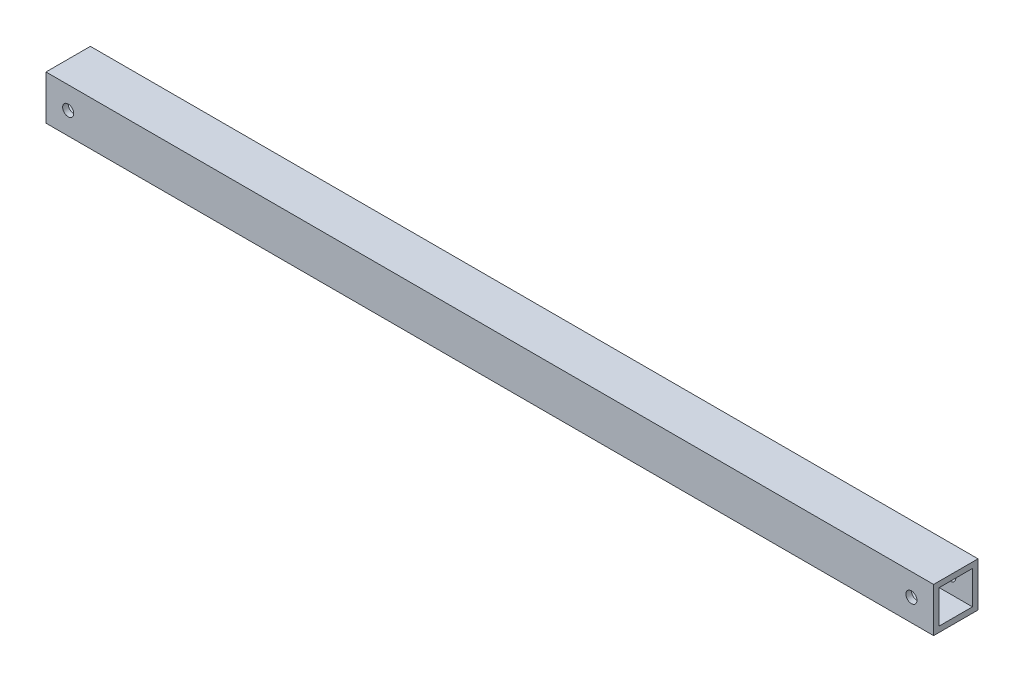
ISO-10303-21;
HEADER;
FILE_DESCRIPTION(('STEP AP214'),'2;1');
FILE_NAME('part.step','',(''),(''),'','','');
FILE_SCHEMA(('AUTOMOTIVE_DESIGN { 1 0 10303 214 1 1 1 1 }'));
ENDSEC;
DATA;
#1=APPLICATION_CONTEXT('core data for automotive mechanical design processes');
#2=APPLICATION_PROTOCOL_DEFINITION('international standard','automotive_design',2000,#1);
#3=PRODUCT_CONTEXT('',#1,'mechanical');
#4=PRODUCT('Part','Part','',(#3));
#5=PRODUCT_RELATED_PRODUCT_CATEGORY('part','',(#4));
#6=PRODUCT_DEFINITION_FORMATION('','',#4);
#7=PRODUCT_DEFINITION_CONTEXT('part definition',#1,'design');
#8=PRODUCT_DEFINITION('design','',#6,#7);
#9=PRODUCT_DEFINITION_SHAPE('','',#8);
#10=(LENGTH_UNIT() NAMED_UNIT(*) SI_UNIT(.MILLI.,.METRE.));
#11=(NAMED_UNIT(*) PLANE_ANGLE_UNIT() SI_UNIT($,.RADIAN.));
#12=(NAMED_UNIT(*) SI_UNIT($,.STERADIAN.) SOLID_ANGLE_UNIT());
#13=UNCERTAINTY_MEASURE_WITH_UNIT(LENGTH_MEASURE(1.E-05),#10,'distance_accuracy_value','');
#14=(GEOMETRIC_REPRESENTATION_CONTEXT(3) GLOBAL_UNCERTAINTY_ASSIGNED_CONTEXT((#13)) GLOBAL_UNIT_ASSIGNED_CONTEXT((#10,
#11,#12)) REPRESENTATION_CONTEXT('',''));
#15=CARTESIAN_POINT('',(0.,0.,0.));
#16=DIRECTION('',(0.,0.,1.));
#17=DIRECTION('',(1.,0.,0.));
#18=AXIS2_PLACEMENT_3D('',#15,#16,#17);
#19=CARTESIAN_POINT('',(254.,-12.7,25.4));
#20=DIRECTION('',(-1.,0.,0.));
#21=DIRECTION('',(0.,0.,1.));
#22=AXIS2_PLACEMENT_3D('',#19,#20,#21);
#23=PLANE('',#22);
#24=DIRECTION('',(0.,1.,0.));
#25=VECTOR('',#24,1.);
#26=CARTESIAN_POINT('',(254.,-12.7,0.));
#27=LINE('',#26,#25);
#28=CARTESIAN_POINT('',(254.,-12.7,0.));
#29=VERTEX_POINT('',#28);
#30=CARTESIAN_POINT('',(254.,12.7,0.));
#31=VERTEX_POINT('',#30);
#32=EDGE_CURVE('E134',#29,#31,#27,.T.);
#33=ORIENTED_EDGE('',*,*,#32,.T.);
#34=DIRECTION('',(0.,0.,-1.));
#35=VECTOR('',#34,1.);
#36=CARTESIAN_POINT('',(254.,12.7,25.4));
#37=LINE('',#36,#35);
#38=CARTESIAN_POINT('',(254.,12.7,25.4));
#39=VERTEX_POINT('',#38);
#40=EDGE_CURVE('E11',#39,#31,#37,.T.);
#41=ORIENTED_EDGE('',*,*,#40,.F.);
#42=DIRECTION('',(0.,1.,0.));
#43=VECTOR('',#42,1.);
#44=CARTESIAN_POINT('',(254.,-12.7,25.4));
#45=LINE('',#44,#43);
#46=CARTESIAN_POINT('',(254.,-12.7,25.4));
#47=VERTEX_POINT('',#46);
#48=EDGE_CURVE('E138',#47,#39,#45,.T.);
#49=ORIENTED_EDGE('',*,*,#48,.F.);
#50=DIRECTION('',(0.,0.,-1.));
#51=VECTOR('',#50,1.);
#52=CARTESIAN_POINT('',(254.,-12.7,25.4));
#53=LINE('',#52,#51);
#54=EDGE_CURVE('E148',#47,#29,#53,.T.);
#55=ORIENTED_EDGE('',*,*,#54,.T.);
#56=EDGE_LOOP('',(#33,#41,#49,#55));
#57=FACE_BOUND('',#56,.T.);
#58=DIRECTION('',(0.,0.,-1.));
#59=VECTOR('',#58,1.);
#60=CARTESIAN_POINT('',(254.,9.52035864154581,0.));
#61=LINE('',#60,#59);
#62=CARTESIAN_POINT('',(254.,9.52035864154581,22.225));
#63=VERTEX_POINT('',#62);
#64=CARTESIAN_POINT('',(254.,9.52035864154581,3.175));
#65=VERTEX_POINT('',#64);
#66=EDGE_CURVE('E49',#63,#65,#61,.T.);
#67=ORIENTED_EDGE('',*,*,#66,.T.);
#68=DIRECTION('',(0.,1.,0.));
#69=VECTOR('',#68,1.);
#70=CARTESIAN_POINT('',(254.,0.,3.175));
#71=LINE('',#70,#69);
#72=CARTESIAN_POINT('',(254.,-9.52035864154582,3.175));
#73=VERTEX_POINT('',#72);
#74=EDGE_CURVE('E116',#73,#65,#71,.T.);
#75=ORIENTED_EDGE('',*,*,#74,.F.);
#76=DIRECTION('',(0.,0.,-1.));
#77=VECTOR('',#76,1.);
#78=CARTESIAN_POINT('',(254.,-9.52035864154582,0.));
#79=LINE('',#78,#77);
#80=CARTESIAN_POINT('',(254.,-9.52035864154582,22.225));
#81=VERTEX_POINT('',#80);
#82=EDGE_CURVE('E119',#81,#73,#79,.T.);
#83=ORIENTED_EDGE('',*,*,#82,.F.);
#84=DIRECTION('',(0.,1.,0.));
#85=VECTOR('',#84,1.);
#86=CARTESIAN_POINT('',(254.,0.,22.225));
#87=LINE('',#86,#85);
#88=EDGE_CURVE('E128',#81,#63,#87,.T.);
#89=ORIENTED_EDGE('',*,*,#88,.T.);
#90=EDGE_LOOP('',(#67,#75,#83,#89));
#91=FACE_BOUND('',#90,.T.);
#92=ADVANCED_FACE('F33',(#57,#91),#23,.F.);
#93=CARTESIAN_POINT('',(-254.,-12.7,25.4));
#94=DIRECTION('',(1.,0.,0.));
#95=DIRECTION('',(0.,0.,-1.));
#96=AXIS2_PLACEMENT_3D('',#93,#94,#95);
#97=PLANE('',#96);
#98=DIRECTION('',(0.,-1.,0.));
#99=VECTOR('',#98,1.);
#100=CARTESIAN_POINT('',(-254.,-12.7,0.));
#101=LINE('',#100,#99);
#102=CARTESIAN_POINT('',(-254.,12.7,0.));
#103=VERTEX_POINT('',#102);
#104=CARTESIAN_POINT('',(-254.,-12.7,0.));
#105=VERTEX_POINT('',#104);
#106=EDGE_CURVE('E153',#103,#105,#101,.T.);
#107=ORIENTED_EDGE('',*,*,#106,.T.);
#108=DIRECTION('',(0.,0.,-1.));
#109=VECTOR('',#108,1.);
#110=CARTESIAN_POINT('',(-254.,-12.7,25.4));
#111=LINE('',#110,#109);
#112=CARTESIAN_POINT('',(-254.,-12.7,25.4));
#113=VERTEX_POINT('',#112);
#114=EDGE_CURVE('E158',#113,#105,#111,.T.);
#115=ORIENTED_EDGE('',*,*,#114,.F.);
#116=DIRECTION('',(0.,-1.,0.));
#117=VECTOR('',#116,1.);
#118=CARTESIAN_POINT('',(-254.,-12.7,25.4));
#119=LINE('',#118,#117);
#120=CARTESIAN_POINT('',(-254.,12.7,25.4));
#121=VERTEX_POINT('',#120);
#122=EDGE_CURVE('E144',#121,#113,#119,.T.);
#123=ORIENTED_EDGE('',*,*,#122,.F.);
#124=DIRECTION('',(0.,0.,-1.));
#125=VECTOR('',#124,1.);
#126=CARTESIAN_POINT('',(-254.,12.7,25.4));
#127=LINE('',#126,#125);
#128=EDGE_CURVE('E41',#121,#103,#127,.T.);
#129=ORIENTED_EDGE('',*,*,#128,.T.);
#130=EDGE_LOOP('',(#107,#115,#123,#129));
#131=FACE_BOUND('',#130,.T.);
#132=DIRECTION('',(0.,0.,-1.));
#133=VECTOR('',#132,1.);
#134=CARTESIAN_POINT('',(-254.,9.52035864154581,0.));
#135=LINE('',#134,#133);
#136=CARTESIAN_POINT('',(-254.,9.52035864154581,22.225));
#137=VERTEX_POINT('',#136);
#138=CARTESIAN_POINT('',(-254.,9.52035864154581,3.175));
#139=VERTEX_POINT('',#138);
#140=EDGE_CURVE('E107',#137,#139,#135,.T.);
#141=ORIENTED_EDGE('',*,*,#140,.F.);
#142=DIRECTION('',(0.,1.,0.));
#143=VECTOR('',#142,1.);
#144=CARTESIAN_POINT('',(-254.,0.,22.225));
#145=LINE('',#144,#143);
#146=CARTESIAN_POINT('',(-254.,-9.52035864154582,22.225));
#147=VERTEX_POINT('',#146);
#148=EDGE_CURVE('E99',#147,#137,#145,.T.);
#149=ORIENTED_EDGE('',*,*,#148,.F.);
#150=DIRECTION('',(0.,0.,-1.));
#151=VECTOR('',#150,1.);
#152=CARTESIAN_POINT('',(-254.,-9.52035864154582,0.));
#153=LINE('',#152,#151);
#154=CARTESIAN_POINT('',(-254.,-9.52035864154582,3.175));
#155=VERTEX_POINT('',#154);
#156=EDGE_CURVE('E57',#147,#155,#153,.T.);
#157=ORIENTED_EDGE('',*,*,#156,.T.);
#158=DIRECTION('',(0.,1.,0.));
#159=VECTOR('',#158,1.);
#160=CARTESIAN_POINT('',(-254.,0.,3.175));
#161=LINE('',#160,#159);
#162=EDGE_CURVE('E111',#155,#139,#161,.T.);
#163=ORIENTED_EDGE('',*,*,#162,.T.);
#164=EDGE_LOOP('',(#141,#149,#157,#163));
#165=FACE_BOUND('',#164,.T.);
#166=ADVANCED_FACE('F114',(#131,#165),#97,.F.);
#167=CARTESIAN_POINT('',(-254.,12.7,25.4));
#168=DIRECTION('',(0.,-1.,0.));
#169=DIRECTION('',(0.,0.,-1.));
#170=AXIS2_PLACEMENT_3D('',#167,#168,#169);
#171=PLANE('',#170);
#172=DIRECTION('',(-1.,0.,0.));
#173=VECTOR('',#172,1.);
#174=CARTESIAN_POINT('',(-254.,12.7,0.));
#175=LINE('',#174,#173);
#176=EDGE_CURVE('E151',#31,#103,#175,.T.);
#177=ORIENTED_EDGE('',*,*,#176,.T.);
#178=ORIENTED_EDGE('',*,*,#128,.F.);
#179=DIRECTION('',(-1.,0.,0.));
#180=VECTOR('',#179,1.);
#181=CARTESIAN_POINT('',(-254.,12.7,25.4));
#182=LINE('',#181,#180);
#183=EDGE_CURVE('E141',#39,#121,#182,.T.);
#184=ORIENTED_EDGE('',*,*,#183,.F.);
#185=ORIENTED_EDGE('',*,*,#40,.T.);
#186=EDGE_LOOP('',(#177,#178,#184,#185));
#187=FACE_BOUND('',#186,.T.);
#188=ADVANCED_FACE('F211',(#187),#171,.F.);
#189=CARTESIAN_POINT('',(-254.,-12.7,25.4));
#190=DIRECTION('',(0.,1.,0.));
#191=DIRECTION('',(0.,0.,1.));
#192=AXIS2_PLACEMENT_3D('',#189,#190,#191);
#193=PLANE('',#192);
#194=DIRECTION('',(1.,0.,0.));
#195=VECTOR('',#194,1.);
#196=CARTESIAN_POINT('',(-254.,-12.7,0.));
#197=LINE('',#196,#195);
#198=EDGE_CURVE('E142',#105,#29,#197,.T.);
#199=ORIENTED_EDGE('',*,*,#198,.T.);
#200=ORIENTED_EDGE('',*,*,#54,.F.);
#201=DIRECTION('',(1.,0.,0.));
#202=VECTOR('',#201,1.);
#203=CARTESIAN_POINT('',(-254.,-12.7,25.4));
#204=LINE('',#203,#202);
#205=EDGE_CURVE('E146',#113,#47,#204,.T.);
#206=ORIENTED_EDGE('',*,*,#205,.F.);
#207=ORIENTED_EDGE('',*,*,#114,.T.);
#208=EDGE_LOOP('',(#199,#200,#206,#207));
#209=FACE_BOUND('',#208,.T.);
#210=ADVANCED_FACE('F257',(#209),#193,.F.);
#211=CARTESIAN_POINT('',(0.,0.,25.4));
#212=DIRECTION('',(0.,0.,-1.));
#213=DIRECTION('',(-1.,0.,0.));
#214=AXIS2_PLACEMENT_3D('',#211,#212,#213);
#215=PLANE('',#214);
#216=CARTESIAN_POINT('',(-241.3,0.,25.4));
#217=DIRECTION('',(0.,0.,1.));
#218=DIRECTION('',(1.,0.,0.));
#219=AXIS2_PLACEMENT_3D('',#216,#217,#218);
#220=CIRCLE('',#219,3.175);
#221=CARTESIAN_POINT('',(-238.125,0.,25.4));
#222=VERTEX_POINT('',#221);
#223=EDGE_CURVE('E165',#222,#222,#220,.T.);
#224=ORIENTED_EDGE('',*,*,#223,.F.);
#225=EDGE_LOOP('',(#224));
#226=FACE_BOUND('',#225,.T.);
#227=CARTESIAN_POINT('',(241.3,0.,25.4));
#228=DIRECTION('',(0.,0.,1.));
#229=DIRECTION('',(1.,0.,0.));
#230=AXIS2_PLACEMENT_3D('',#227,#228,#229);
#231=CIRCLE('',#230,3.175);
#232=CARTESIAN_POINT('',(244.475,0.,25.4));
#233=VERTEX_POINT('',#232);
#234=EDGE_CURVE('E172',#233,#233,#231,.T.);
#235=ORIENTED_EDGE('',*,*,#234,.F.);
#236=EDGE_LOOP('',(#235));
#237=FACE_BOUND('',#236,.T.);
#238=ORIENTED_EDGE('',*,*,#48,.T.);
#239=ORIENTED_EDGE('',*,*,#183,.T.);
#240=ORIENTED_EDGE('',*,*,#122,.T.);
#241=ORIENTED_EDGE('',*,*,#205,.T.);
#242=EDGE_LOOP('',(#238,#239,#240,#241));
#243=FACE_BOUND('',#242,.T.);
#244=ADVANCED_FACE('F242',(#226,#237,#243),#215,.F.);
#245=CARTESIAN_POINT('',(0.,0.,0.));
#246=DIRECTION('',(0.,0.,-1.));
#247=DIRECTION('',(-1.,0.,0.));
#248=AXIS2_PLACEMENT_3D('',#245,#246,#247);
#249=PLANE('',#248);
#250=CARTESIAN_POINT('',(-241.3,0.,0.));
#251=DIRECTION('',(0.,0.,-1.));
#252=DIRECTION('',(-1.,0.,0.));
#253=AXIS2_PLACEMENT_3D('',#250,#251,#252);
#254=CIRCLE('',#253,3.175);
#255=CARTESIAN_POINT('',(-244.475,0.,0.));
#256=VERTEX_POINT('',#255);
#257=EDGE_CURVE('E122',#256,#256,#254,.T.);
#258=ORIENTED_EDGE('',*,*,#257,.F.);
#259=EDGE_LOOP('',(#258));
#260=FACE_BOUND('',#259,.T.);
#261=CARTESIAN_POINT('',(241.3,0.,0.));
#262=DIRECTION('',(0.,0.,-1.));
#263=DIRECTION('',(-1.,0.,0.));
#264=AXIS2_PLACEMENT_3D('',#261,#262,#263);
#265=CIRCLE('',#264,3.175);
#266=CARTESIAN_POINT('',(238.125,0.,0.));
#267=VERTEX_POINT('',#266);
#268=EDGE_CURVE('E169',#267,#267,#265,.T.);
#269=ORIENTED_EDGE('',*,*,#268,.F.);
#270=EDGE_LOOP('',(#269));
#271=FACE_BOUND('',#270,.T.);
#272=ORIENTED_EDGE('',*,*,#32,.F.);
#273=ORIENTED_EDGE('',*,*,#198,.F.);
#274=ORIENTED_EDGE('',*,*,#106,.F.);
#275=ORIENTED_EDGE('',*,*,#176,.F.);
#276=EDGE_LOOP('',(#272,#273,#274,#275));
#277=FACE_BOUND('',#276,.T.);
#278=ADVANCED_FACE('F225',(#260,#271,#277),#249,.T.);
#279=CARTESIAN_POINT('',(-254.,9.52035864154581,0.));
#280=DIRECTION('',(0.,-1.,0.));
#281=DIRECTION('',(0.,0.,-1.));
#282=AXIS2_PLACEMENT_3D('',#279,#280,#281);
#283=PLANE('',#282);
#284=ORIENTED_EDGE('',*,*,#66,.F.);
#285=DIRECTION('',(1.,0.,0.));
#286=VECTOR('',#285,1.);
#287=CARTESIAN_POINT('',(-254.,9.52035864154581,22.225));
#288=LINE('',#287,#286);
#289=EDGE_CURVE('E102',#137,#63,#288,.T.);
#290=ORIENTED_EDGE('',*,*,#289,.F.);
#291=ORIENTED_EDGE('',*,*,#140,.T.);
#292=DIRECTION('',(1.,0.,0.));
#293=VECTOR('',#292,1.);
#294=CARTESIAN_POINT('',(-254.,9.52035864154581,3.175));
#295=LINE('',#294,#293);
#296=EDGE_CURVE('E132',#139,#65,#295,.T.);
#297=ORIENTED_EDGE('',*,*,#296,.T.);
#298=EDGE_LOOP('',(#284,#290,#291,#297));
#299=FACE_BOUND('',#298,.T.);
#300=ADVANCED_FACE('F109',(#299),#283,.T.);
#301=CARTESIAN_POINT('',(-254.,0.,3.175));
#302=DIRECTION('',(0.,0.,-1.));
#303=DIRECTION('',(-1.,0.,0.));
#304=AXIS2_PLACEMENT_3D('',#301,#302,#303);
#305=PLANE('',#304);
#306=CARTESIAN_POINT('',(-241.3,0.,3.17499999999998));
#307=DIRECTION('',(0.,0.,-1.));
#308=DIRECTION('',(-1.,0.,0.));
#309=AXIS2_PLACEMENT_3D('',#306,#307,#308);
#310=CIRCLE('',#309,3.175);
#311=CARTESIAN_POINT('',(-244.475,0.,3.17499999999998));
#312=VERTEX_POINT('',#311);
#313=EDGE_CURVE('E180',#312,#312,#310,.T.);
#314=ORIENTED_EDGE('',*,*,#313,.T.);
#315=EDGE_LOOP('',(#314));
#316=FACE_BOUND('',#315,.T.);
#317=CARTESIAN_POINT('',(241.3,0.,3.17499999999998));
#318=DIRECTION('',(0.,0.,-1.));
#319=DIRECTION('',(-1.,0.,0.));
#320=AXIS2_PLACEMENT_3D('',#317,#318,#319);
#321=CIRCLE('',#320,3.175);
#322=CARTESIAN_POINT('',(238.125,0.,3.17499999999998));
#323=VERTEX_POINT('',#322);
#324=EDGE_CURVE('E164',#323,#323,#321,.T.);
#325=ORIENTED_EDGE('',*,*,#324,.T.);
#326=EDGE_LOOP('',(#325));
#327=FACE_BOUND('',#326,.T.);
#328=ORIENTED_EDGE('',*,*,#74,.T.);
#329=ORIENTED_EDGE('',*,*,#296,.F.);
#330=ORIENTED_EDGE('',*,*,#162,.F.);
#331=DIRECTION('',(1.,0.,0.));
#332=VECTOR('',#331,1.);
#333=CARTESIAN_POINT('',(-254.,-9.52035864154582,3.175));
#334=LINE('',#333,#332);
#335=EDGE_CURVE('E135',#155,#73,#334,.T.);
#336=ORIENTED_EDGE('',*,*,#335,.T.);
#337=EDGE_LOOP('',(#328,#329,#330,#336));
#338=FACE_BOUND('',#337,.T.);
#339=ADVANCED_FACE('F203',(#316,#327,#338),#305,.F.);
#340=CARTESIAN_POINT('',(-254.,-9.52035864154582,0.));
#341=DIRECTION('',(0.,-1.,0.));
#342=DIRECTION('',(0.,0.,-1.));
#343=AXIS2_PLACEMENT_3D('',#340,#341,#342);
#344=PLANE('',#343);
#345=ORIENTED_EDGE('',*,*,#82,.T.);
#346=ORIENTED_EDGE('',*,*,#335,.F.);
#347=ORIENTED_EDGE('',*,*,#156,.F.);
#348=DIRECTION('',(1.,0.,0.));
#349=VECTOR('',#348,1.);
#350=CARTESIAN_POINT('',(-254.,-9.52035864154582,22.225));
#351=LINE('',#350,#349);
#352=EDGE_CURVE('E104',#147,#81,#351,.T.);
#353=ORIENTED_EDGE('',*,*,#352,.T.);
#354=EDGE_LOOP('',(#345,#346,#347,#353));
#355=FACE_BOUND('',#354,.T.);
#356=ADVANCED_FACE('F193',(#355),#344,.F.);
#357=CARTESIAN_POINT('',(-254.,0.,22.225));
#358=DIRECTION('',(0.,0.,-1.));
#359=DIRECTION('',(0.,1.,0.));
#360=AXIS2_PLACEMENT_3D('',#357,#358,#359);
#361=PLANE('',#360);
#362=CARTESIAN_POINT('',(-241.3,0.,22.2250000000001));
#363=DIRECTION('',(0.,0.,-1.));
#364=DIRECTION('',(0.,1.,0.));
#365=AXIS2_PLACEMENT_3D('',#362,#363,#364);
#366=CIRCLE('',#365,3.175);
#367=CARTESIAN_POINT('',(-241.3,3.175,22.2250000000001));
#368=VERTEX_POINT('',#367);
#369=EDGE_CURVE('E36',#368,#368,#366,.T.);
#370=ORIENTED_EDGE('',*,*,#369,.F.);
#371=EDGE_LOOP('',(#370));
#372=FACE_BOUND('',#371,.T.);
#373=CARTESIAN_POINT('',(241.3,0.,22.2250000000001));
#374=DIRECTION('',(0.,0.,-1.));
#375=DIRECTION('',(0.,1.,0.));
#376=AXIS2_PLACEMENT_3D('',#373,#374,#375);
#377=CIRCLE('',#376,3.175);
#378=CARTESIAN_POINT('',(241.3,3.175,22.2250000000001));
#379=VERTEX_POINT('',#378);
#380=EDGE_CURVE('E162',#379,#379,#377,.T.);
#381=ORIENTED_EDGE('',*,*,#380,.F.);
#382=EDGE_LOOP('',(#381));
#383=FACE_BOUND('',#382,.T.);
#384=ORIENTED_EDGE('',*,*,#88,.F.);
#385=ORIENTED_EDGE('',*,*,#352,.F.);
#386=ORIENTED_EDGE('',*,*,#148,.T.);
#387=ORIENTED_EDGE('',*,*,#289,.T.);
#388=EDGE_LOOP('',(#384,#385,#386,#387));
#389=FACE_BOUND('',#388,.T.);
#390=ADVANCED_FACE('F101',(#372,#383,#389),#361,.T.);
#391=CARTESIAN_POINT('',(241.3,0.,-482.6));
#392=DIRECTION('',(0.,0.,1.));
#393=DIRECTION('',(1.,0.,0.));
#394=AXIS2_PLACEMENT_3D('',#391,#392,#393);
#395=CYLINDRICAL_SURFACE('',#394,3.175);
#396=ORIENTED_EDGE('',*,*,#380,.T.);
#397=EDGE_LOOP('',(#396));
#398=FACE_BOUND('',#397,.T.);
#399=ORIENTED_EDGE('',*,*,#234,.T.);
#400=EDGE_LOOP('',(#399));
#401=FACE_BOUND('',#400,.T.);
#402=ADVANCED_FACE('F192',(#398,#401),#395,.F.);
#403=CARTESIAN_POINT('',(-241.3,0.,-482.6));
#404=DIRECTION('',(0.,0.,1.));
#405=DIRECTION('',(1.,0.,0.));
#406=AXIS2_PLACEMENT_3D('',#403,#404,#405);
#407=CYLINDRICAL_SURFACE('',#406,3.175);
#408=ORIENTED_EDGE('',*,*,#369,.T.);
#409=EDGE_LOOP('',(#408));
#410=FACE_BOUND('',#409,.T.);
#411=ORIENTED_EDGE('',*,*,#223,.T.);
#412=EDGE_LOOP('',(#411));
#413=FACE_BOUND('',#412,.T.);
#414=ADVANCED_FACE('F188',(#410,#413),#407,.F.);
#415=ORIENTED_EDGE('',*,*,#268,.T.);
#416=EDGE_LOOP('',(#415));
#417=FACE_BOUND('',#416,.T.);
#418=ORIENTED_EDGE('',*,*,#324,.F.);
#419=EDGE_LOOP('',(#418));
#420=FACE_BOUND('',#419,.T.);
#421=ADVANCED_FACE('F201',(#417,#420),#395,.F.);
#422=ORIENTED_EDGE('',*,*,#257,.T.);
#423=EDGE_LOOP('',(#422));
#424=FACE_BOUND('',#423,.T.);
#425=ORIENTED_EDGE('',*,*,#313,.F.);
#426=EDGE_LOOP('',(#425));
#427=FACE_BOUND('',#426,.T.);
#428=ADVANCED_FACE('F229',(#424,#427),#407,.F.);
#429=CLOSED_SHELL('',(#92,#166,#188,#210,#244,#278,#300,#339,#356,#390,#402,#414,#421,#428));
#430=MANIFOLD_SOLID_BREP('B2',#429);
#431=ADVANCED_BREP_SHAPE_REPRESENTATION('',(#18,#430),#14);
#432=SHAPE_DEFINITION_REPRESENTATION(#9,#431);
ENDSEC;
END-ISO-10303-21;
